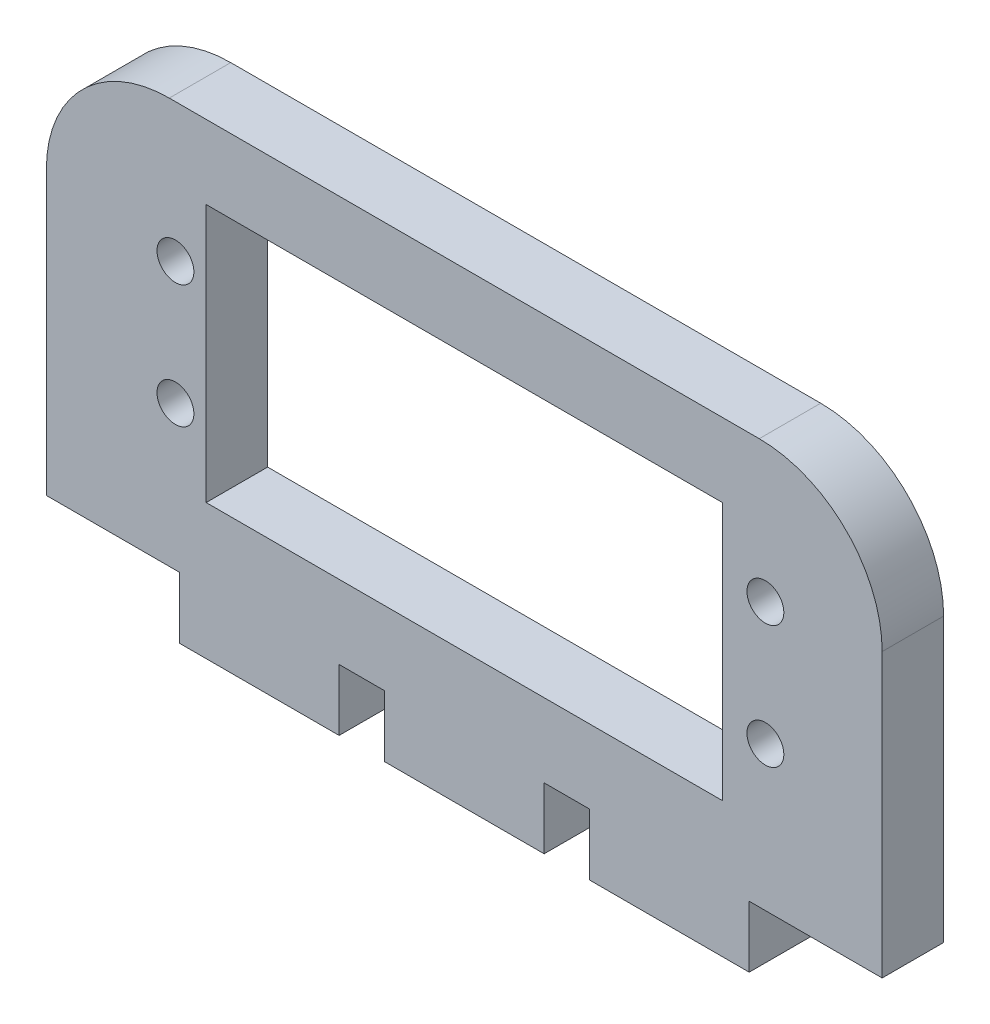
ISO-10303-21;
HEADER;
FILE_DESCRIPTION(('STEP AP214'),'2;1');
FILE_NAME('part.step','',(''),(''),'','','');
FILE_SCHEMA(('AUTOMOTIVE_DESIGN { 1 0 10303 214 1 1 1 1 }'));
ENDSEC;
DATA;
#1=APPLICATION_CONTEXT('core data for automotive mechanical design processes');
#2=APPLICATION_PROTOCOL_DEFINITION('international standard','automotive_design',2000,#1);
#3=PRODUCT_CONTEXT('',#1,'mechanical');
#4=PRODUCT('Part','Part','',(#3));
#5=PRODUCT_RELATED_PRODUCT_CATEGORY('part','',(#4));
#6=PRODUCT_DEFINITION_FORMATION('','',#4);
#7=PRODUCT_DEFINITION_CONTEXT('part definition',#1,'design');
#8=PRODUCT_DEFINITION('design','',#6,#7);
#9=PRODUCT_DEFINITION_SHAPE('','',#8);
#10=(LENGTH_UNIT() NAMED_UNIT(*) SI_UNIT(.MILLI.,.METRE.));
#11=(NAMED_UNIT(*) PLANE_ANGLE_UNIT() SI_UNIT($,.RADIAN.));
#12=(NAMED_UNIT(*) SI_UNIT($,.STERADIAN.) SOLID_ANGLE_UNIT());
#13=UNCERTAINTY_MEASURE_WITH_UNIT(LENGTH_MEASURE(1.E-05),#10,'distance_accuracy_value','');
#14=(GEOMETRIC_REPRESENTATION_CONTEXT(3) GLOBAL_UNCERTAINTY_ASSIGNED_CONTEXT((#13)) GLOBAL_UNIT_ASSIGNED_CONTEXT((#10,
#11,#12)) REPRESENTATION_CONTEXT('',''));
#15=CARTESIAN_POINT('',(0.,0.,0.));
#16=DIRECTION('',(0.,0.,1.));
#17=DIRECTION('',(1.,0.,0.));
#18=AXIS2_PLACEMENT_3D('',#15,#16,#17);
#19=CARTESIAN_POINT('',(29.9130434782608,23.,5.));
#20=DIRECTION('',(0.,0.,-1.));
#21=DIRECTION('',(-1.,0.,0.));
#22=AXIS2_PLACEMENT_3D('',#19,#20,#21);
#23=CYLINDRICAL_SURFACE('',#22,10.);
#24=DIRECTION('',(0.,0.,-1.));
#25=VECTOR('',#24,1.);
#26=CARTESIAN_POINT('',(29.9130434782608,33.,5.));
#27=LINE('',#26,#25);
#28=CARTESIAN_POINT('',(29.9130434782608,33.,5.));
#29=VERTEX_POINT('',#28);
#30=CARTESIAN_POINT('',(29.9130434782608,33.,0.));
#31=VERTEX_POINT('',#30);
#32=EDGE_CURVE('E343',#29,#31,#27,.T.);
#33=ORIENTED_EDGE('',*,*,#32,.F.);
#34=CARTESIAN_POINT('',(29.9130434782608,23.,5.));
#35=DIRECTION('',(0.,0.,1.));
#36=DIRECTION('',(1.,0.,0.));
#37=AXIS2_PLACEMENT_3D('',#34,#35,#36);
#38=CIRCLE('',#37,10.);
#39=CARTESIAN_POINT('',(39.9130434782608,23.,5.));
#40=VERTEX_POINT('',#39);
#41=EDGE_CURVE('E40',#40,#29,#38,.T.);
#42=ORIENTED_EDGE('',*,*,#41,.F.);
#43=DIRECTION('',(0.,0.,-1.));
#44=VECTOR('',#43,1.);
#45=CARTESIAN_POINT('',(39.9130434782608,23.,5.));
#46=LINE('',#45,#44);
#47=CARTESIAN_POINT('',(39.9130434782608,23.,0.));
#48=VERTEX_POINT('',#47);
#49=EDGE_CURVE('E346',#48,#40,#46,.F.);
#50=ORIENTED_EDGE('',*,*,#49,.F.);
#51=CARTESIAN_POINT('',(29.9130434782608,23.,0.));
#52=DIRECTION('',(0.,0.,1.));
#53=DIRECTION('',(1.,0.,0.));
#54=AXIS2_PLACEMENT_3D('',#51,#52,#53);
#55=CIRCLE('',#54,10.);
#56=EDGE_CURVE('E11',#31,#48,#55,.F.);
#57=ORIENTED_EDGE('',*,*,#56,.F.);
#58=EDGE_LOOP('',(#33,#42,#50,#57));
#59=FACE_BOUND('',#58,.T.);
#60=ADVANCED_FACE('F33',(#59),#23,.T.);
#61=CARTESIAN_POINT('',(-18.0869565217392,23.,5.));
#62=DIRECTION('',(0.,0.,-1.));
#63=DIRECTION('',(-1.,0.,0.));
#64=AXIS2_PLACEMENT_3D('',#61,#62,#63);
#65=CYLINDRICAL_SURFACE('',#64,10.);
#66=DIRECTION('',(0.,0.,-1.));
#67=VECTOR('',#66,1.);
#68=CARTESIAN_POINT('',(-28.0869565217392,23.,5.));
#69=LINE('',#68,#67);
#70=CARTESIAN_POINT('',(-28.0869565217392,23.,5.));
#71=VERTEX_POINT('',#70);
#72=CARTESIAN_POINT('',(-28.0869565217392,23.,0.));
#73=VERTEX_POINT('',#72);
#74=EDGE_CURVE('E332',#71,#73,#69,.T.);
#75=ORIENTED_EDGE('',*,*,#74,.F.);
#76=CARTESIAN_POINT('',(-18.0869565217392,23.,5.));
#77=DIRECTION('',(0.,0.,1.));
#78=DIRECTION('',(1.,0.,0.));
#79=AXIS2_PLACEMENT_3D('',#76,#77,#78);
#80=CIRCLE('',#79,10.);
#81=CARTESIAN_POINT('',(-18.0869565217392,33.,5.));
#82=VERTEX_POINT('',#81);
#83=EDGE_CURVE('E338',#82,#71,#80,.T.);
#84=ORIENTED_EDGE('',*,*,#83,.F.);
#85=DIRECTION('',(0.,0.,-1.));
#86=VECTOR('',#85,1.);
#87=CARTESIAN_POINT('',(-18.0869565217392,33.,5.));
#88=LINE('',#87,#86);
#89=CARTESIAN_POINT('',(-18.0869565217392,33.,0.));
#90=VERTEX_POINT('',#89);
#91=EDGE_CURVE('E335',#90,#82,#88,.F.);
#92=ORIENTED_EDGE('',*,*,#91,.F.);
#93=CARTESIAN_POINT('',(-18.0869565217392,23.,0.));
#94=DIRECTION('',(0.,0.,1.));
#95=DIRECTION('',(1.,0.,0.));
#96=AXIS2_PLACEMENT_3D('',#93,#94,#95);
#97=CIRCLE('',#96,10.);
#98=EDGE_CURVE('E340',#73,#90,#97,.F.);
#99=ORIENTED_EDGE('',*,*,#98,.F.);
#100=EDGE_LOOP('',(#75,#84,#92,#99));
#101=FACE_BOUND('',#100,.T.);
#102=ADVANCED_FACE('F356',(#101),#65,.T.);
#103=CARTESIAN_POINT('',(0.,0.,5.));
#104=DIRECTION('',(0.,0.,1.));
#105=DIRECTION('',(1.,0.,0.));
#106=AXIS2_PLACEMENT_3D('',#103,#104,#105);
#107=PLANE('',#106);
#108=CARTESIAN_POINT('',(-17.5869565217392,21.75,5.));
#109=DIRECTION('',(0.,0.,1.));
#110=DIRECTION('',(1.,0.,0.));
#111=AXIS2_PLACEMENT_3D('',#108,#109,#110);
#112=CIRCLE('',#111,1.49999999999996);
#113=CARTESIAN_POINT('',(-16.0869565217392,21.75,5.));
#114=VERTEX_POINT('',#113);
#115=EDGE_CURVE('E678',#114,#114,#112,.T.);
#116=ORIENTED_EDGE('',*,*,#115,.F.);
#117=EDGE_LOOP('',(#116));
#118=FACE_BOUND('',#117,.T.);
#119=CARTESIAN_POINT('',(30.4130434782608,21.75,5.));
#120=DIRECTION('',(0.,0.,1.));
#121=DIRECTION('',(1.,0.,0.));
#122=AXIS2_PLACEMENT_3D('',#119,#120,#121);
#123=CIRCLE('',#122,1.49999999999998);
#124=CARTESIAN_POINT('',(31.9130434782608,21.75,5.));
#125=VERTEX_POINT('',#124);
#126=EDGE_CURVE('E214',#125,#125,#123,.T.);
#127=ORIENTED_EDGE('',*,*,#126,.F.);
#128=EDGE_LOOP('',(#127));
#129=FACE_BOUND('',#128,.T.);
#130=DIRECTION('',(0.,1.,0.));
#131=VECTOR('',#130,1.);
#132=CARTESIAN_POINT('',(39.9130434782609,0.,5.));
#133=LINE('',#132,#131);
#134=CARTESIAN_POINT('',(39.9130434782609,0.,5.));
#135=VERTEX_POINT('',#134);
#136=EDGE_CURVE('E254',#135,#40,#133,.T.);
#137=ORIENTED_EDGE('',*,*,#136,.T.);
#138=ORIENTED_EDGE('',*,*,#41,.T.);
#139=DIRECTION('',(-1.,0.,0.));
#140=VECTOR('',#139,1.);
#141=CARTESIAN_POINT('',(39.9130434782608,33.,5.));
#142=LINE('',#141,#140);
#143=EDGE_CURVE('E257',#29,#82,#142,.T.);
#144=ORIENTED_EDGE('',*,*,#143,.T.);
#145=ORIENTED_EDGE('',*,*,#83,.T.);
#146=DIRECTION('',(0.,-1.,0.));
#147=VECTOR('',#146,1.);
#148=CARTESIAN_POINT('',(-28.0869565217392,33.,5.));
#149=LINE('',#148,#147);
#150=CARTESIAN_POINT('',(-28.0869565217392,0.,5.));
#151=VERTEX_POINT('',#150);
#152=EDGE_CURVE('E225',#71,#151,#149,.T.);
#153=ORIENTED_EDGE('',*,*,#152,.T.);
#154=DIRECTION('',(1.,0.,0.));
#155=VECTOR('',#154,1.);
#156=CARTESIAN_POINT('',(-28.0869565217392,0.,5.));
#157=LINE('',#156,#155);
#158=CARTESIAN_POINT('',(-17.2690909541131,0.,5.));
#159=VERTEX_POINT('',#158);
#160=EDGE_CURVE('E227',#151,#159,#157,.T.);
#161=ORIENTED_EDGE('',*,*,#160,.T.);
#162=DIRECTION('',(0.,-1.,0.));
#163=VECTOR('',#162,1.);
#164=CARTESIAN_POINT('',(-17.2690909541131,0.,5.));
#165=LINE('',#164,#163);
#166=CARTESIAN_POINT('',(-17.2690909541131,-4.99999999999998,5.));
#167=VERTEX_POINT('',#166);
#168=EDGE_CURVE('E230',#159,#167,#165,.T.);
#169=ORIENTED_EDGE('',*,*,#168,.T.);
#170=DIRECTION('',(1.,0.,0.));
#171=VECTOR('',#170,1.);
#172=CARTESIAN_POINT('',(-17.2690909541131,-4.99999999999998,5.));
#173=LINE('',#172,#171);
#174=CARTESIAN_POINT('',(-4.26909095411313,-4.99999999999998,5.));
#175=VERTEX_POINT('',#174);
#176=EDGE_CURVE('E232',#167,#175,#173,.T.);
#177=ORIENTED_EDGE('',*,*,#176,.T.);
#178=DIRECTION('',(0.,1.,0.));
#179=VECTOR('',#178,1.);
#180=CARTESIAN_POINT('',(-4.26909095411313,-4.99999999999998,5.));
#181=LINE('',#180,#179);
#182=CARTESIAN_POINT('',(-4.26909095411313,0.,5.));
#183=VERTEX_POINT('',#182);
#184=EDGE_CURVE('E234',#175,#183,#181,.T.);
#185=ORIENTED_EDGE('',*,*,#184,.T.);
#186=DIRECTION('',(1.,0.,0.));
#187=VECTOR('',#186,1.);
#188=CARTESIAN_POINT('',(-4.26909095411313,0.,5.));
#189=LINE('',#188,#187);
#190=CARTESIAN_POINT('',(-0.586956521739158,0.,5.));
#191=VERTEX_POINT('',#190);
#192=EDGE_CURVE('E236',#183,#191,#189,.T.);
#193=ORIENTED_EDGE('',*,*,#192,.T.);
#194=DIRECTION('',(0.,-1.,0.));
#195=VECTOR('',#194,1.);
#196=CARTESIAN_POINT('',(-0.586956521739158,-4.99999999999998,5.));
#197=LINE('',#196,#195);
#198=CARTESIAN_POINT('',(-0.586956521739158,-4.99999999999998,5.));
#199=VERTEX_POINT('',#198);
#200=EDGE_CURVE('E238',#191,#199,#197,.T.);
#201=ORIENTED_EDGE('',*,*,#200,.T.);
#202=DIRECTION('',(1.,0.,0.));
#203=VECTOR('',#202,1.);
#204=CARTESIAN_POINT('',(-0.586956521739158,-4.99999999999998,5.));
#205=LINE('',#204,#203);
#206=CARTESIAN_POINT('',(12.4130434782608,-4.99999999999998,5.));
#207=VERTEX_POINT('',#206);
#208=EDGE_CURVE('E240',#199,#207,#205,.T.);
#209=ORIENTED_EDGE('',*,*,#208,.T.);
#210=DIRECTION('',(0.,1.,0.));
#211=VECTOR('',#210,1.);
#212=CARTESIAN_POINT('',(12.4130434782608,-4.99999999999998,5.));
#213=LINE('',#212,#211);
#214=CARTESIAN_POINT('',(12.4130434782608,0.,5.));
#215=VERTEX_POINT('',#214);
#216=EDGE_CURVE('E242',#207,#215,#213,.T.);
#217=ORIENTED_EDGE('',*,*,#216,.T.);
#218=DIRECTION('',(1.,0.,0.));
#219=VECTOR('',#218,1.);
#220=CARTESIAN_POINT('',(12.4130434782608,0.,5.));
#221=LINE('',#220,#219);
#222=CARTESIAN_POINT('',(16.0951779106348,0.,5.));
#223=VERTEX_POINT('',#222);
#224=EDGE_CURVE('E244',#215,#223,#221,.T.);
#225=ORIENTED_EDGE('',*,*,#224,.T.);
#226=DIRECTION('',(0.,-1.,0.));
#227=VECTOR('',#226,1.);
#228=CARTESIAN_POINT('',(16.0951779106348,-4.99999999999998,5.));
#229=LINE('',#228,#227);
#230=CARTESIAN_POINT('',(16.0951779106348,-4.99999999999998,5.));
#231=VERTEX_POINT('',#230);
#232=EDGE_CURVE('E246',#223,#231,#229,.T.);
#233=ORIENTED_EDGE('',*,*,#232,.T.);
#234=DIRECTION('',(1.,0.,0.));
#235=VECTOR('',#234,1.);
#236=CARTESIAN_POINT('',(16.0951779106348,-4.99999999999998,5.));
#237=LINE('',#236,#235);
#238=CARTESIAN_POINT('',(29.0951779106348,-4.99999999999998,5.));
#239=VERTEX_POINT('',#238);
#240=EDGE_CURVE('E248',#231,#239,#237,.T.);
#241=ORIENTED_EDGE('',*,*,#240,.T.);
#242=DIRECTION('',(0.,1.,0.));
#243=VECTOR('',#242,1.);
#244=CARTESIAN_POINT('',(29.0951779106348,0.,5.));
#245=LINE('',#244,#243);
#246=CARTESIAN_POINT('',(29.0951779106348,0.,5.));
#247=VERTEX_POINT('',#246);
#248=EDGE_CURVE('E250',#239,#247,#245,.T.);
#249=ORIENTED_EDGE('',*,*,#248,.T.);
#250=DIRECTION('',(1.,0.,0.));
#251=VECTOR('',#250,1.);
#252=CARTESIAN_POINT('',(29.0951779106348,0.,5.));
#253=LINE('',#252,#251);
#254=EDGE_CURVE('E252',#247,#135,#253,.T.);
#255=ORIENTED_EDGE('',*,*,#254,.T.);
#256=EDGE_LOOP('',(#137,#138,#144,#145,#153,#161,#169,#177,#185,#193,#201,#209,#217,#225,#233,
#241,#249,#255));
#257=FACE_BOUND('',#256,.T.);
#258=DIRECTION('',(1.,0.,0.));
#259=VECTOR('',#258,1.);
#260=CARTESIAN_POINT('',(-15.0869565217392,6.,5.));
#261=LINE('',#260,#259);
#262=CARTESIAN_POINT('',(-15.0869565217392,6.,5.));
#263=VERTEX_POINT('',#262);
#264=CARTESIAN_POINT('',(26.9130434782608,6.,5.));
#265=VERTEX_POINT('',#264);
#266=EDGE_CURVE('E190',#263,#265,#261,.T.);
#267=ORIENTED_EDGE('',*,*,#266,.F.);
#268=DIRECTION('',(0.,-1.,0.));
#269=VECTOR('',#268,1.);
#270=CARTESIAN_POINT('',(-15.0869565217392,6.,5.));
#271=LINE('',#270,#269);
#272=CARTESIAN_POINT('',(-15.0869565217392,27.,5.));
#273=VERTEX_POINT('',#272);
#274=EDGE_CURVE('E180',#273,#263,#271,.T.);
#275=ORIENTED_EDGE('',*,*,#274,.F.);
#276=DIRECTION('',(-1.,0.,0.));
#277=VECTOR('',#276,1.);
#278=CARTESIAN_POINT('',(-15.0869565217392,27.,5.));
#279=LINE('',#278,#277);
#280=CARTESIAN_POINT('',(26.9130434782608,27.,5.));
#281=VERTEX_POINT('',#280);
#282=EDGE_CURVE('E207',#281,#273,#279,.T.);
#283=ORIENTED_EDGE('',*,*,#282,.F.);
#284=DIRECTION('',(0.,1.,0.));
#285=VECTOR('',#284,1.);
#286=CARTESIAN_POINT('',(26.9130434782608,27.,5.));
#287=LINE('',#286,#285);
#288=EDGE_CURVE('E205',#265,#281,#287,.T.);
#289=ORIENTED_EDGE('',*,*,#288,.F.);
#290=EDGE_LOOP('',(#267,#275,#283,#289));
#291=FACE_BOUND('',#290,.T.);
#292=CARTESIAN_POINT('',(30.4130434782608,11.75,5.));
#293=DIRECTION('',(0.,0.,1.));
#294=DIRECTION('',(1.,0.,0.));
#295=AXIS2_PLACEMENT_3D('',#292,#293,#294);
#296=CIRCLE('',#295,1.49999999999998);
#297=CARTESIAN_POINT('',(31.9130434782608,11.75,5.));
#298=VERTEX_POINT('',#297);
#299=EDGE_CURVE('E684',#298,#298,#296,.T.);
#300=ORIENTED_EDGE('',*,*,#299,.F.);
#301=EDGE_LOOP('',(#300));
#302=FACE_BOUND('',#301,.T.);
#303=CARTESIAN_POINT('',(-17.5869565217392,11.75,5.));
#304=DIRECTION('',(0.,0.,1.));
#305=DIRECTION('',(1.,0.,0.));
#306=AXIS2_PLACEMENT_3D('',#303,#304,#305);
#307=CIRCLE('',#306,1.49999999999996);
#308=CARTESIAN_POINT('',(-16.0869565217392,11.75,5.));
#309=VERTEX_POINT('',#308);
#310=EDGE_CURVE('E669',#309,#309,#307,.T.);
#311=ORIENTED_EDGE('',*,*,#310,.F.);
#312=EDGE_LOOP('',(#311));
#313=FACE_BOUND('',#312,.T.);
#314=ADVANCED_FACE('F202',(#118,#129,#257,#291,#302,#313),#107,.T.);
#315=CARTESIAN_POINT('',(0.,0.,0.));
#316=DIRECTION('',(0.,0.,1.));
#317=DIRECTION('',(1.,0.,0.));
#318=AXIS2_PLACEMENT_3D('',#315,#316,#317);
#319=PLANE('',#318);
#320=DIRECTION('',(-1.,0.,0.));
#321=VECTOR('',#320,1.);
#322=CARTESIAN_POINT('',(39.9130434782608,33.,0.));
#323=LINE('',#322,#321);
#324=EDGE_CURVE('E228',#31,#90,#323,.T.);
#325=ORIENTED_EDGE('',*,*,#324,.F.);
#326=ORIENTED_EDGE('',*,*,#56,.T.);
#327=DIRECTION('',(0.,1.,0.));
#328=VECTOR('',#327,1.);
#329=CARTESIAN_POINT('',(39.9130434782609,0.,0.));
#330=LINE('',#329,#328);
#331=CARTESIAN_POINT('',(39.9130434782609,0.,0.));
#332=VERTEX_POINT('',#331);
#333=EDGE_CURVE('E287',#332,#48,#330,.T.);
#334=ORIENTED_EDGE('',*,*,#333,.F.);
#335=DIRECTION('',(1.,0.,0.));
#336=VECTOR('',#335,1.);
#337=CARTESIAN_POINT('',(29.0951779106348,0.,0.));
#338=LINE('',#337,#336);
#339=CARTESIAN_POINT('',(29.0951779106348,0.,0.));
#340=VERTEX_POINT('',#339);
#341=EDGE_CURVE('E285',#340,#332,#338,.T.);
#342=ORIENTED_EDGE('',*,*,#341,.F.);
#343=DIRECTION('',(0.,1.,0.));
#344=VECTOR('',#343,1.);
#345=CARTESIAN_POINT('',(29.0951779106348,0.,0.));
#346=LINE('',#345,#344);
#347=CARTESIAN_POINT('',(29.0951779106348,-4.99999999999998,0.));
#348=VERTEX_POINT('',#347);
#349=EDGE_CURVE('E283',#348,#340,#346,.T.);
#350=ORIENTED_EDGE('',*,*,#349,.F.);
#351=DIRECTION('',(1.,0.,0.));
#352=VECTOR('',#351,1.);
#353=CARTESIAN_POINT('',(16.0951779106348,-4.99999999999998,0.));
#354=LINE('',#353,#352);
#355=CARTESIAN_POINT('',(16.0951779106348,-4.99999999999998,0.));
#356=VERTEX_POINT('',#355);
#357=EDGE_CURVE('E281',#356,#348,#354,.T.);
#358=ORIENTED_EDGE('',*,*,#357,.F.);
#359=DIRECTION('',(0.,-1.,0.));
#360=VECTOR('',#359,1.);
#361=CARTESIAN_POINT('',(16.0951779106348,-4.99999999999998,0.));
#362=LINE('',#361,#360);
#363=CARTESIAN_POINT('',(16.0951779106348,0.,0.));
#364=VERTEX_POINT('',#363);
#365=EDGE_CURVE('E279',#364,#356,#362,.T.);
#366=ORIENTED_EDGE('',*,*,#365,.F.);
#367=DIRECTION('',(1.,0.,0.));
#368=VECTOR('',#367,1.);
#369=CARTESIAN_POINT('',(12.4130434782608,0.,0.));
#370=LINE('',#369,#368);
#371=CARTESIAN_POINT('',(12.4130434782608,0.,0.));
#372=VERTEX_POINT('',#371);
#373=EDGE_CURVE('E277',#372,#364,#370,.T.);
#374=ORIENTED_EDGE('',*,*,#373,.F.);
#375=DIRECTION('',(0.,1.,0.));
#376=VECTOR('',#375,1.);
#377=CARTESIAN_POINT('',(12.4130434782608,-4.99999999999998,0.));
#378=LINE('',#377,#376);
#379=CARTESIAN_POINT('',(12.4130434782608,-4.99999999999998,0.));
#380=VERTEX_POINT('',#379);
#381=EDGE_CURVE('E275',#380,#372,#378,.T.);
#382=ORIENTED_EDGE('',*,*,#381,.F.);
#383=DIRECTION('',(1.,0.,0.));
#384=VECTOR('',#383,1.);
#385=CARTESIAN_POINT('',(-0.586956521739158,-4.99999999999998,0.));
#386=LINE('',#385,#384);
#387=CARTESIAN_POINT('',(-0.586956521739158,-4.99999999999998,0.));
#388=VERTEX_POINT('',#387);
#389=EDGE_CURVE('E273',#388,#380,#386,.T.);
#390=ORIENTED_EDGE('',*,*,#389,.F.);
#391=DIRECTION('',(0.,-1.,0.));
#392=VECTOR('',#391,1.);
#393=CARTESIAN_POINT('',(-0.586956521739158,-4.99999999999998,0.));
#394=LINE('',#393,#392);
#395=CARTESIAN_POINT('',(-0.586956521739158,0.,0.));
#396=VERTEX_POINT('',#395);
#397=EDGE_CURVE('E271',#396,#388,#394,.T.);
#398=ORIENTED_EDGE('',*,*,#397,.F.);
#399=DIRECTION('',(1.,0.,0.));
#400=VECTOR('',#399,1.);
#401=CARTESIAN_POINT('',(-4.26909095411313,0.,0.));
#402=LINE('',#401,#400);
#403=CARTESIAN_POINT('',(-4.26909095411313,0.,0.));
#404=VERTEX_POINT('',#403);
#405=EDGE_CURVE('E269',#404,#396,#402,.T.);
#406=ORIENTED_EDGE('',*,*,#405,.F.);
#407=DIRECTION('',(0.,1.,0.));
#408=VECTOR('',#407,1.);
#409=CARTESIAN_POINT('',(-4.26909095411313,-4.99999999999998,0.));
#410=LINE('',#409,#408);
#411=CARTESIAN_POINT('',(-4.26909095411313,-4.99999999999998,0.));
#412=VERTEX_POINT('',#411);
#413=EDGE_CURVE('E267',#412,#404,#410,.T.);
#414=ORIENTED_EDGE('',*,*,#413,.F.);
#415=DIRECTION('',(1.,0.,0.));
#416=VECTOR('',#415,1.);
#417=CARTESIAN_POINT('',(-17.2690909541131,-4.99999999999998,0.));
#418=LINE('',#417,#416);
#419=CARTESIAN_POINT('',(-17.2690909541131,-4.99999999999998,0.));
#420=VERTEX_POINT('',#419);
#421=EDGE_CURVE('E265',#420,#412,#418,.T.);
#422=ORIENTED_EDGE('',*,*,#421,.F.);
#423=DIRECTION('',(0.,-1.,0.));
#424=VECTOR('',#423,1.);
#425=CARTESIAN_POINT('',(-17.2690909541131,0.,0.));
#426=LINE('',#425,#424);
#427=CARTESIAN_POINT('',(-17.2690909541131,0.,0.));
#428=VERTEX_POINT('',#427);
#429=EDGE_CURVE('E263',#428,#420,#426,.T.);
#430=ORIENTED_EDGE('',*,*,#429,.F.);
#431=DIRECTION('',(1.,0.,0.));
#432=VECTOR('',#431,1.);
#433=CARTESIAN_POINT('',(-28.0869565217392,0.,0.));
#434=LINE('',#433,#432);
#435=CARTESIAN_POINT('',(-28.0869565217392,0.,0.));
#436=VERTEX_POINT('',#435);
#437=EDGE_CURVE('E261',#436,#428,#434,.T.);
#438=ORIENTED_EDGE('',*,*,#437,.F.);
#439=DIRECTION('',(0.,-1.,0.));
#440=VECTOR('',#439,1.);
#441=CARTESIAN_POINT('',(-28.0869565217392,33.,0.));
#442=LINE('',#441,#440);
#443=EDGE_CURVE('E198',#73,#436,#442,.T.);
#444=ORIENTED_EDGE('',*,*,#443,.F.);
#445=ORIENTED_EDGE('',*,*,#98,.T.);
#446=EDGE_LOOP('',(#325,#326,#334,#342,#350,#358,#366,#374,#382,#390,#398,#406,#414,#422,#430,
#438,#444,#445));
#447=FACE_BOUND('',#446,.T.);
#448=DIRECTION('',(0.,-1.,0.));
#449=VECTOR('',#448,1.);
#450=CARTESIAN_POINT('',(-15.0869565217392,6.,0.));
#451=LINE('',#450,#449);
#452=CARTESIAN_POINT('',(-15.0869565217392,27.,0.));
#453=VERTEX_POINT('',#452);
#454=CARTESIAN_POINT('',(-15.0869565217392,6.,0.));
#455=VERTEX_POINT('',#454);
#456=EDGE_CURVE('E212',#453,#455,#451,.T.);
#457=ORIENTED_EDGE('',*,*,#456,.T.);
#458=DIRECTION('',(1.,0.,0.));
#459=VECTOR('',#458,1.);
#460=CARTESIAN_POINT('',(-15.0869565217392,6.,0.));
#461=LINE('',#460,#459);
#462=CARTESIAN_POINT('',(26.9130434782608,6.,0.));
#463=VERTEX_POINT('',#462);
#464=EDGE_CURVE('E197',#455,#463,#461,.T.);
#465=ORIENTED_EDGE('',*,*,#464,.T.);
#466=DIRECTION('',(0.,1.,0.));
#467=VECTOR('',#466,1.);
#468=CARTESIAN_POINT('',(26.9130434782608,27.,0.));
#469=LINE('',#468,#467);
#470=CARTESIAN_POINT('',(26.9130434782608,27.,0.));
#471=VERTEX_POINT('',#470);
#472=EDGE_CURVE('E216',#463,#471,#469,.T.);
#473=ORIENTED_EDGE('',*,*,#472,.T.);
#474=DIRECTION('',(-1.,0.,0.));
#475=VECTOR('',#474,1.);
#476=CARTESIAN_POINT('',(-15.0869565217392,27.,0.));
#477=LINE('',#476,#475);
#478=EDGE_CURVE('E191',#471,#453,#477,.T.);
#479=ORIENTED_EDGE('',*,*,#478,.T.);
#480=EDGE_LOOP('',(#457,#465,#473,#479));
#481=FACE_BOUND('',#480,.T.);
#482=CARTESIAN_POINT('',(30.4130434782608,21.75,0.));
#483=DIRECTION('',(0.,0.,1.));
#484=DIRECTION('',(1.,0.,0.));
#485=AXIS2_PLACEMENT_3D('',#482,#483,#484);
#486=CIRCLE('',#485,1.49999999999998);
#487=CARTESIAN_POINT('',(31.9130434782608,21.75,0.));
#488=VERTEX_POINT('',#487);
#489=EDGE_CURVE('E687',#488,#488,#486,.T.);
#490=ORIENTED_EDGE('',*,*,#489,.T.);
#491=EDGE_LOOP('',(#490));
#492=FACE_BOUND('',#491,.T.);
#493=CARTESIAN_POINT('',(30.4130434782608,11.75,0.));
#494=DIRECTION('',(0.,0.,1.));
#495=DIRECTION('',(1.,0.,0.));
#496=AXIS2_PLACEMENT_3D('',#493,#494,#495);
#497=CIRCLE('',#496,1.49999999999998);
#498=CARTESIAN_POINT('',(31.9130434782608,11.75,0.));
#499=VERTEX_POINT('',#498);
#500=EDGE_CURVE('E681',#499,#499,#497,.T.);
#501=ORIENTED_EDGE('',*,*,#500,.T.);
#502=EDGE_LOOP('',(#501));
#503=FACE_BOUND('',#502,.T.);
#504=CARTESIAN_POINT('',(-17.5869565217392,21.75,0.));
#505=DIRECTION('',(0.,0.,1.));
#506=DIRECTION('',(1.,0.,0.));
#507=AXIS2_PLACEMENT_3D('',#504,#505,#506);
#508=CIRCLE('',#507,1.49999999999996);
#509=CARTESIAN_POINT('',(-16.0869565217392,21.75,0.));
#510=VERTEX_POINT('',#509);
#511=EDGE_CURVE('E675',#510,#510,#508,.T.);
#512=ORIENTED_EDGE('',*,*,#511,.T.);
#513=EDGE_LOOP('',(#512));
#514=FACE_BOUND('',#513,.T.);
#515=CARTESIAN_POINT('',(-17.5869565217392,11.75,0.));
#516=DIRECTION('',(0.,0.,1.));
#517=DIRECTION('',(1.,0.,0.));
#518=AXIS2_PLACEMENT_3D('',#515,#516,#517);
#519=CIRCLE('',#518,1.49999999999996);
#520=CARTESIAN_POINT('',(-16.0869565217392,11.75,0.));
#521=VERTEX_POINT('',#520);
#522=EDGE_CURVE('E672',#521,#521,#519,.T.);
#523=ORIENTED_EDGE('',*,*,#522,.T.);
#524=EDGE_LOOP('',(#523));
#525=FACE_BOUND('',#524,.T.);
#526=ADVANCED_FACE('F369',(#447,#481,#492,#503,#514,#525),#319,.F.);
#527=CARTESIAN_POINT('',(-28.0869565217392,33.,5.));
#528=DIRECTION('',(1.,0.,0.));
#529=DIRECTION('',(0.,1.,0.));
#530=AXIS2_PLACEMENT_3D('',#527,#528,#529);
#531=PLANE('',#530);
#532=ORIENTED_EDGE('',*,*,#152,.F.);
#533=ORIENTED_EDGE('',*,*,#74,.T.);
#534=ORIENTED_EDGE('',*,*,#443,.T.);
#535=DIRECTION('',(0.,0.,-1.));
#536=VECTOR('',#535,1.);
#537=CARTESIAN_POINT('',(-28.0869565217392,0.,5.));
#538=LINE('',#537,#536);
#539=EDGE_CURVE('E329',#151,#436,#538,.T.);
#540=ORIENTED_EDGE('',*,*,#539,.F.);
#541=EDGE_LOOP('',(#532,#533,#534,#540));
#542=FACE_BOUND('',#541,.T.);
#543=ADVANCED_FACE('F365',(#542),#531,.F.);
#544=CARTESIAN_POINT('',(-28.0869565217392,0.,5.));
#545=DIRECTION('',(0.,1.,0.));
#546=DIRECTION('',(0.,0.,1.));
#547=AXIS2_PLACEMENT_3D('',#544,#545,#546);
#548=PLANE('',#547);
#549=ORIENTED_EDGE('',*,*,#437,.T.);
#550=DIRECTION('',(0.,0.,-1.));
#551=VECTOR('',#550,1.);
#552=CARTESIAN_POINT('',(-17.2690909541131,0.,5.));
#553=LINE('',#552,#551);
#554=EDGE_CURVE('E326',#159,#428,#553,.T.);
#555=ORIENTED_EDGE('',*,*,#554,.F.);
#556=ORIENTED_EDGE('',*,*,#160,.F.);
#557=ORIENTED_EDGE('',*,*,#539,.T.);
#558=EDGE_LOOP('',(#549,#555,#556,#557));
#559=FACE_BOUND('',#558,.T.);
#560=ADVANCED_FACE('F363',(#559),#548,.F.);
#561=CARTESIAN_POINT('',(-17.2690909541131,0.,5.));
#562=DIRECTION('',(1.,0.,0.));
#563=DIRECTION('',(0.,0.,-1.));
#564=AXIS2_PLACEMENT_3D('',#561,#562,#563);
#565=PLANE('',#564);
#566=ORIENTED_EDGE('',*,*,#429,.T.);
#567=DIRECTION('',(0.,0.,-1.));
#568=VECTOR('',#567,1.);
#569=CARTESIAN_POINT('',(-17.2690909541131,-4.99999999999998,5.));
#570=LINE('',#569,#568);
#571=EDGE_CURVE('E323',#167,#420,#570,.T.);
#572=ORIENTED_EDGE('',*,*,#571,.F.);
#573=ORIENTED_EDGE('',*,*,#168,.F.);
#574=ORIENTED_EDGE('',*,*,#554,.T.);
#575=EDGE_LOOP('',(#566,#572,#573,#574));
#576=FACE_BOUND('',#575,.T.);
#577=ADVANCED_FACE('F373',(#576),#565,.F.);
#578=CARTESIAN_POINT('',(-17.2690909541131,-4.99999999999998,5.));
#579=DIRECTION('',(0.,1.,0.));
#580=DIRECTION('',(0.,0.,1.));
#581=AXIS2_PLACEMENT_3D('',#578,#579,#580);
#582=PLANE('',#581);
#583=ORIENTED_EDGE('',*,*,#421,.T.);
#584=DIRECTION('',(0.,0.,-1.));
#585=VECTOR('',#584,1.);
#586=CARTESIAN_POINT('',(-4.26909095411313,-4.99999999999998,5.));
#587=LINE('',#586,#585);
#588=EDGE_CURVE('E320',#175,#412,#587,.T.);
#589=ORIENTED_EDGE('',*,*,#588,.F.);
#590=ORIENTED_EDGE('',*,*,#176,.F.);
#591=ORIENTED_EDGE('',*,*,#571,.T.);
#592=EDGE_LOOP('',(#583,#589,#590,#591));
#593=FACE_BOUND('',#592,.T.);
#594=ADVANCED_FACE('F380',(#593),#582,.F.);
#595=CARTESIAN_POINT('',(-4.26909095411313,-4.99999999999998,5.));
#596=DIRECTION('',(-1.,0.,0.));
#597=DIRECTION('',(0.,0.,1.));
#598=AXIS2_PLACEMENT_3D('',#595,#596,#597);
#599=PLANE('',#598);
#600=ORIENTED_EDGE('',*,*,#413,.T.);
#601=DIRECTION('',(0.,0.,-1.));
#602=VECTOR('',#601,1.);
#603=CARTESIAN_POINT('',(-4.26909095411313,0.,5.));
#604=LINE('',#603,#602);
#605=EDGE_CURVE('E317',#183,#404,#604,.T.);
#606=ORIENTED_EDGE('',*,*,#605,.F.);
#607=ORIENTED_EDGE('',*,*,#184,.F.);
#608=ORIENTED_EDGE('',*,*,#588,.T.);
#609=EDGE_LOOP('',(#600,#606,#607,#608));
#610=FACE_BOUND('',#609,.T.);
#611=ADVANCED_FACE('F383',(#610),#599,.F.);
#612=CARTESIAN_POINT('',(-4.26909095411313,0.,5.));
#613=DIRECTION('',(0.,1.,0.));
#614=DIRECTION('',(0.,0.,1.));
#615=AXIS2_PLACEMENT_3D('',#612,#613,#614);
#616=PLANE('',#615);
#617=ORIENTED_EDGE('',*,*,#405,.T.);
#618=DIRECTION('',(0.,0.,-1.));
#619=VECTOR('',#618,1.);
#620=CARTESIAN_POINT('',(-0.586956521739158,0.,5.));
#621=LINE('',#620,#619);
#622=EDGE_CURVE('E314',#191,#396,#621,.T.);
#623=ORIENTED_EDGE('',*,*,#622,.F.);
#624=ORIENTED_EDGE('',*,*,#192,.F.);
#625=ORIENTED_EDGE('',*,*,#605,.T.);
#626=EDGE_LOOP('',(#617,#623,#624,#625));
#627=FACE_BOUND('',#626,.T.);
#628=ADVANCED_FACE('F388',(#627),#616,.F.);
#629=CARTESIAN_POINT('',(-0.586956521739158,-4.99999999999998,5.));
#630=DIRECTION('',(1.,0.,0.));
#631=DIRECTION('',(0.,0.,-1.));
#632=AXIS2_PLACEMENT_3D('',#629,#630,#631);
#633=PLANE('',#632);
#634=ORIENTED_EDGE('',*,*,#397,.T.);
#635=DIRECTION('',(0.,0.,-1.));
#636=VECTOR('',#635,1.);
#637=CARTESIAN_POINT('',(-0.586956521739158,-4.99999999999998,5.));
#638=LINE('',#637,#636);
#639=EDGE_CURVE('E311',#199,#388,#638,.T.);
#640=ORIENTED_EDGE('',*,*,#639,.F.);
#641=ORIENTED_EDGE('',*,*,#200,.F.);
#642=ORIENTED_EDGE('',*,*,#622,.T.);
#643=EDGE_LOOP('',(#634,#640,#641,#642));
#644=FACE_BOUND('',#643,.T.);
#645=ADVANCED_FACE('F394',(#644),#633,.F.);
#646=CARTESIAN_POINT('',(-0.586956521739158,-4.99999999999998,5.));
#647=DIRECTION('',(0.,1.,0.));
#648=DIRECTION('',(0.,0.,1.));
#649=AXIS2_PLACEMENT_3D('',#646,#647,#648);
#650=PLANE('',#649);
#651=ORIENTED_EDGE('',*,*,#389,.T.);
#652=DIRECTION('',(0.,0.,-1.));
#653=VECTOR('',#652,1.);
#654=CARTESIAN_POINT('',(12.4130434782608,-4.99999999999998,5.));
#655=LINE('',#654,#653);
#656=EDGE_CURVE('E308',#207,#380,#655,.T.);
#657=ORIENTED_EDGE('',*,*,#656,.F.);
#658=ORIENTED_EDGE('',*,*,#208,.F.);
#659=ORIENTED_EDGE('',*,*,#639,.T.);
#660=EDGE_LOOP('',(#651,#657,#658,#659));
#661=FACE_BOUND('',#660,.T.);
#662=ADVANCED_FACE('F398',(#661),#650,.F.);
#663=CARTESIAN_POINT('',(12.4130434782608,-4.99999999999998,5.));
#664=DIRECTION('',(-1.,0.,0.));
#665=DIRECTION('',(0.,0.,1.));
#666=AXIS2_PLACEMENT_3D('',#663,#664,#665);
#667=PLANE('',#666);
#668=ORIENTED_EDGE('',*,*,#381,.T.);
#669=DIRECTION('',(0.,0.,-1.));
#670=VECTOR('',#669,1.);
#671=CARTESIAN_POINT('',(12.4130434782608,0.,5.));
#672=LINE('',#671,#670);
#673=EDGE_CURVE('E305',#215,#372,#672,.T.);
#674=ORIENTED_EDGE('',*,*,#673,.F.);
#675=ORIENTED_EDGE('',*,*,#216,.F.);
#676=ORIENTED_EDGE('',*,*,#656,.T.);
#677=EDGE_LOOP('',(#668,#674,#675,#676));
#678=FACE_BOUND('',#677,.T.);
#679=ADVANCED_FACE('F403',(#678),#667,.F.);
#680=CARTESIAN_POINT('',(12.4130434782608,0.,5.));
#681=DIRECTION('',(0.,1.,0.));
#682=DIRECTION('',(-1.,0.,0.));
#683=AXIS2_PLACEMENT_3D('',#680,#681,#682);
#684=PLANE('',#683);
#685=ORIENTED_EDGE('',*,*,#373,.T.);
#686=DIRECTION('',(0.,0.,-1.));
#687=VECTOR('',#686,1.);
#688=CARTESIAN_POINT('',(16.0951779106348,0.,5.));
#689=LINE('',#688,#687);
#690=EDGE_CURVE('E302',#223,#364,#689,.T.);
#691=ORIENTED_EDGE('',*,*,#690,.F.);
#692=ORIENTED_EDGE('',*,*,#224,.F.);
#693=ORIENTED_EDGE('',*,*,#673,.T.);
#694=EDGE_LOOP('',(#685,#691,#692,#693));
#695=FACE_BOUND('',#694,.T.);
#696=ADVANCED_FACE('F409',(#695),#684,.F.);
#697=CARTESIAN_POINT('',(16.0951779106348,-4.99999999999998,5.));
#698=DIRECTION('',(1.,0.,0.));
#699=DIRECTION('',(0.,0.,-1.));
#700=AXIS2_PLACEMENT_3D('',#697,#698,#699);
#701=PLANE('',#700);
#702=ORIENTED_EDGE('',*,*,#365,.T.);
#703=DIRECTION('',(0.,0.,-1.));
#704=VECTOR('',#703,1.);
#705=CARTESIAN_POINT('',(16.0951779106348,-4.99999999999998,5.));
#706=LINE('',#705,#704);
#707=EDGE_CURVE('E299',#231,#356,#706,.T.);
#708=ORIENTED_EDGE('',*,*,#707,.F.);
#709=ORIENTED_EDGE('',*,*,#232,.F.);
#710=ORIENTED_EDGE('',*,*,#690,.T.);
#711=EDGE_LOOP('',(#702,#708,#709,#710));
#712=FACE_BOUND('',#711,.T.);
#713=ADVANCED_FACE('F413',(#712),#701,.F.);
#714=CARTESIAN_POINT('',(16.0951779106348,-4.99999999999998,5.));
#715=DIRECTION('',(0.,1.,0.));
#716=DIRECTION('',(0.,0.,1.));
#717=AXIS2_PLACEMENT_3D('',#714,#715,#716);
#718=PLANE('',#717);
#719=ORIENTED_EDGE('',*,*,#357,.T.);
#720=DIRECTION('',(0.,0.,-1.));
#721=VECTOR('',#720,1.);
#722=CARTESIAN_POINT('',(29.0951779106348,-4.99999999999998,5.));
#723=LINE('',#722,#721);
#724=EDGE_CURVE('E296',#239,#348,#723,.T.);
#725=ORIENTED_EDGE('',*,*,#724,.F.);
#726=ORIENTED_EDGE('',*,*,#240,.F.);
#727=ORIENTED_EDGE('',*,*,#707,.T.);
#728=EDGE_LOOP('',(#719,#725,#726,#727));
#729=FACE_BOUND('',#728,.T.);
#730=ADVANCED_FACE('F418',(#729),#718,.F.);
#731=CARTESIAN_POINT('',(29.0951779106348,0.,5.));
#732=DIRECTION('',(-1.,0.,0.));
#733=DIRECTION('',(0.,0.,1.));
#734=AXIS2_PLACEMENT_3D('',#731,#732,#733);
#735=PLANE('',#734);
#736=ORIENTED_EDGE('',*,*,#349,.T.);
#737=DIRECTION('',(0.,0.,-1.));
#738=VECTOR('',#737,1.);
#739=CARTESIAN_POINT('',(29.0951779106348,0.,5.));
#740=LINE('',#739,#738);
#741=EDGE_CURVE('E293',#247,#340,#740,.T.);
#742=ORIENTED_EDGE('',*,*,#741,.F.);
#743=ORIENTED_EDGE('',*,*,#248,.F.);
#744=ORIENTED_EDGE('',*,*,#724,.T.);
#745=EDGE_LOOP('',(#736,#742,#743,#744));
#746=FACE_BOUND('',#745,.T.);
#747=ADVANCED_FACE('F424',(#746),#735,.F.);
#748=CARTESIAN_POINT('',(29.0951779106348,0.,5.));
#749=DIRECTION('',(0.,1.,0.));
#750=DIRECTION('',(0.,0.,1.));
#751=AXIS2_PLACEMENT_3D('',#748,#749,#750);
#752=PLANE('',#751);
#753=ORIENTED_EDGE('',*,*,#341,.T.);
#754=DIRECTION('',(0.,0.,-1.));
#755=VECTOR('',#754,1.);
#756=CARTESIAN_POINT('',(39.9130434782609,0.,5.));
#757=LINE('',#756,#755);
#758=EDGE_CURVE('E259',#135,#332,#757,.T.);
#759=ORIENTED_EDGE('',*,*,#758,.F.);
#760=ORIENTED_EDGE('',*,*,#254,.F.);
#761=ORIENTED_EDGE('',*,*,#741,.T.);
#762=EDGE_LOOP('',(#753,#759,#760,#761));
#763=FACE_BOUND('',#762,.T.);
#764=ADVANCED_FACE('F428',(#763),#752,.F.);
#765=CARTESIAN_POINT('',(39.9130434782609,0.,5.));
#766=DIRECTION('',(-1.,0.,0.));
#767=DIRECTION('',(0.,-1.,0.));
#768=AXIS2_PLACEMENT_3D('',#765,#766,#767);
#769=PLANE('',#768);
#770=ORIENTED_EDGE('',*,*,#333,.T.);
#771=ORIENTED_EDGE('',*,*,#49,.T.);
#772=ORIENTED_EDGE('',*,*,#136,.F.);
#773=ORIENTED_EDGE('',*,*,#758,.T.);
#774=EDGE_LOOP('',(#770,#771,#772,#773));
#775=FACE_BOUND('',#774,.T.);
#776=ADVANCED_FACE('F430',(#775),#769,.F.);
#777=CARTESIAN_POINT('',(39.9130434782608,33.,5.));
#778=DIRECTION('',(0.,-1.,0.));
#779=DIRECTION('',(0.,0.,-1.));
#780=AXIS2_PLACEMENT_3D('',#777,#778,#779);
#781=PLANE('',#780);
#782=ORIENTED_EDGE('',*,*,#143,.F.);
#783=ORIENTED_EDGE('',*,*,#32,.T.);
#784=ORIENTED_EDGE('',*,*,#324,.T.);
#785=ORIENTED_EDGE('',*,*,#91,.T.);
#786=EDGE_LOOP('',(#782,#783,#784,#785));
#787=FACE_BOUND('',#786,.T.);
#788=ADVANCED_FACE('F352',(#787),#781,.F.);
#789=CARTESIAN_POINT('',(-15.0869565217392,6.,5.));
#790=DIRECTION('',(1.,0.,0.));
#791=DIRECTION('',(0.,0.,-1.));
#792=AXIS2_PLACEMENT_3D('',#789,#790,#791);
#793=PLANE('',#792);
#794=ORIENTED_EDGE('',*,*,#456,.F.);
#795=DIRECTION('',(0.,0.,-1.));
#796=VECTOR('',#795,1.);
#797=CARTESIAN_POINT('',(-15.0869565217392,27.,5.));
#798=LINE('',#797,#796);
#799=EDGE_CURVE('E186',#273,#453,#798,.T.);
#800=ORIENTED_EDGE('',*,*,#799,.F.);
#801=ORIENTED_EDGE('',*,*,#274,.T.);
#802=DIRECTION('',(0.,0.,-1.));
#803=VECTOR('',#802,1.);
#804=CARTESIAN_POINT('',(-15.0869565217392,6.,5.));
#805=LINE('',#804,#803);
#806=EDGE_CURVE('E183',#263,#455,#805,.T.);
#807=ORIENTED_EDGE('',*,*,#806,.T.);
#808=EDGE_LOOP('',(#794,#800,#801,#807));
#809=FACE_BOUND('',#808,.T.);
#810=ADVANCED_FACE('F182',(#809),#793,.T.);
#811=CARTESIAN_POINT('',(-15.0869565217392,6.,5.));
#812=DIRECTION('',(0.,1.,0.));
#813=DIRECTION('',(0.,0.,1.));
#814=AXIS2_PLACEMENT_3D('',#811,#812,#813);
#815=PLANE('',#814);
#816=ORIENTED_EDGE('',*,*,#464,.F.);
#817=ORIENTED_EDGE('',*,*,#806,.F.);
#818=ORIENTED_EDGE('',*,*,#266,.T.);
#819=DIRECTION('',(0.,0.,-1.));
#820=VECTOR('',#819,1.);
#821=CARTESIAN_POINT('',(26.9130434782608,6.,5.));
#822=LINE('',#821,#820);
#823=EDGE_CURVE('E199',#265,#463,#822,.T.);
#824=ORIENTED_EDGE('',*,*,#823,.T.);
#825=EDGE_LOOP('',(#816,#817,#818,#824));
#826=FACE_BOUND('',#825,.T.);
#827=ADVANCED_FACE('F194',(#826),#815,.T.);
#828=CARTESIAN_POINT('',(26.9130434782608,27.,5.));
#829=DIRECTION('',(-1.,0.,0.));
#830=DIRECTION('',(0.,0.,1.));
#831=AXIS2_PLACEMENT_3D('',#828,#829,#830);
#832=PLANE('',#831);
#833=ORIENTED_EDGE('',*,*,#472,.F.);
#834=ORIENTED_EDGE('',*,*,#823,.F.);
#835=ORIENTED_EDGE('',*,*,#288,.T.);
#836=DIRECTION('',(0.,0.,-1.));
#837=VECTOR('',#836,1.);
#838=CARTESIAN_POINT('',(26.9130434782608,27.,5.));
#839=LINE('',#838,#837);
#840=EDGE_CURVE('E222',#281,#471,#839,.T.);
#841=ORIENTED_EDGE('',*,*,#840,.T.);
#842=EDGE_LOOP('',(#833,#834,#835,#841));
#843=FACE_BOUND('',#842,.T.);
#844=ADVANCED_FACE('F501',(#843),#832,.T.);
#845=CARTESIAN_POINT('',(-15.0869565217392,27.,5.));
#846=DIRECTION('',(0.,-1.,0.));
#847=DIRECTION('',(0.,0.,-1.));
#848=AXIS2_PLACEMENT_3D('',#845,#846,#847);
#849=PLANE('',#848);
#850=ORIENTED_EDGE('',*,*,#478,.F.);
#851=ORIENTED_EDGE('',*,*,#840,.F.);
#852=ORIENTED_EDGE('',*,*,#282,.T.);
#853=ORIENTED_EDGE('',*,*,#799,.T.);
#854=EDGE_LOOP('',(#850,#851,#852,#853));
#855=FACE_BOUND('',#854,.T.);
#856=ADVANCED_FACE('F510',(#855),#849,.T.);
#857=CARTESIAN_POINT('',(30.4130434782608,21.75,5.));
#858=DIRECTION('',(0.,0.,-1.));
#859=DIRECTION('',(-1.,0.,0.));
#860=AXIS2_PLACEMENT_3D('',#857,#858,#859);
#861=CYLINDRICAL_SURFACE('',#860,1.49999999999998);
#862=ORIENTED_EDGE('',*,*,#126,.T.);
#863=EDGE_LOOP('',(#862));
#864=FACE_BOUND('',#863,.T.);
#865=ORIENTED_EDGE('',*,*,#489,.F.);
#866=EDGE_LOOP('',(#865));
#867=FACE_BOUND('',#866,.T.);
#868=ADVANCED_FACE('F520',(#864,#867),#861,.F.);
#869=CARTESIAN_POINT('',(30.4130434782608,11.75,5.));
#870=DIRECTION('',(0.,0.,-1.));
#871=DIRECTION('',(-1.,0.,0.));
#872=AXIS2_PLACEMENT_3D('',#869,#870,#871);
#873=CYLINDRICAL_SURFACE('',#872,1.49999999999998);
#874=ORIENTED_EDGE('',*,*,#299,.T.);
#875=EDGE_LOOP('',(#874));
#876=FACE_BOUND('',#875,.T.);
#877=ORIENTED_EDGE('',*,*,#500,.F.);
#878=EDGE_LOOP('',(#877));
#879=FACE_BOUND('',#878,.T.);
#880=ADVANCED_FACE('F530',(#876,#879),#873,.F.);
#881=CARTESIAN_POINT('',(-17.5869565217392,21.75,5.));
#882=DIRECTION('',(0.,0.,-1.));
#883=DIRECTION('',(-1.,0.,0.));
#884=AXIS2_PLACEMENT_3D('',#881,#882,#883);
#885=CYLINDRICAL_SURFACE('',#884,1.49999999999996);
#886=ORIENTED_EDGE('',*,*,#115,.T.);
#887=EDGE_LOOP('',(#886));
#888=FACE_BOUND('',#887,.T.);
#889=ORIENTED_EDGE('',*,*,#511,.F.);
#890=EDGE_LOOP('',(#889));
#891=FACE_BOUND('',#890,.T.);
#892=ADVANCED_FACE('F540',(#888,#891),#885,.F.);
#893=CARTESIAN_POINT('',(-17.5869565217392,11.75,5.));
#894=DIRECTION('',(0.,0.,-1.));
#895=DIRECTION('',(-1.,0.,0.));
#896=AXIS2_PLACEMENT_3D('',#893,#894,#895);
#897=CYLINDRICAL_SURFACE('',#896,1.49999999999996);
#898=ORIENTED_EDGE('',*,*,#310,.T.);
#899=EDGE_LOOP('',(#898));
#900=FACE_BOUND('',#899,.T.);
#901=ORIENTED_EDGE('',*,*,#522,.F.);
#902=EDGE_LOOP('',(#901));
#903=FACE_BOUND('',#902,.T.);
#904=ADVANCED_FACE('F550',(#900,#903),#897,.F.);
#905=CLOSED_SHELL('',(#60,#102,#314,#526,#543,#560,#577,#594,#611,#628,#645,#662,#679,#696,#713,
#730,#747,#764,#776,#788,#810,#827,#844,#856,#868,#880,#892,#904));
#906=MANIFOLD_SOLID_BREP('B2',#905);
#907=ADVANCED_BREP_SHAPE_REPRESENTATION('',(#18,#906),#14);
#908=SHAPE_DEFINITION_REPRESENTATION(#9,#907);
ENDSEC;
END-ISO-10303-21;
